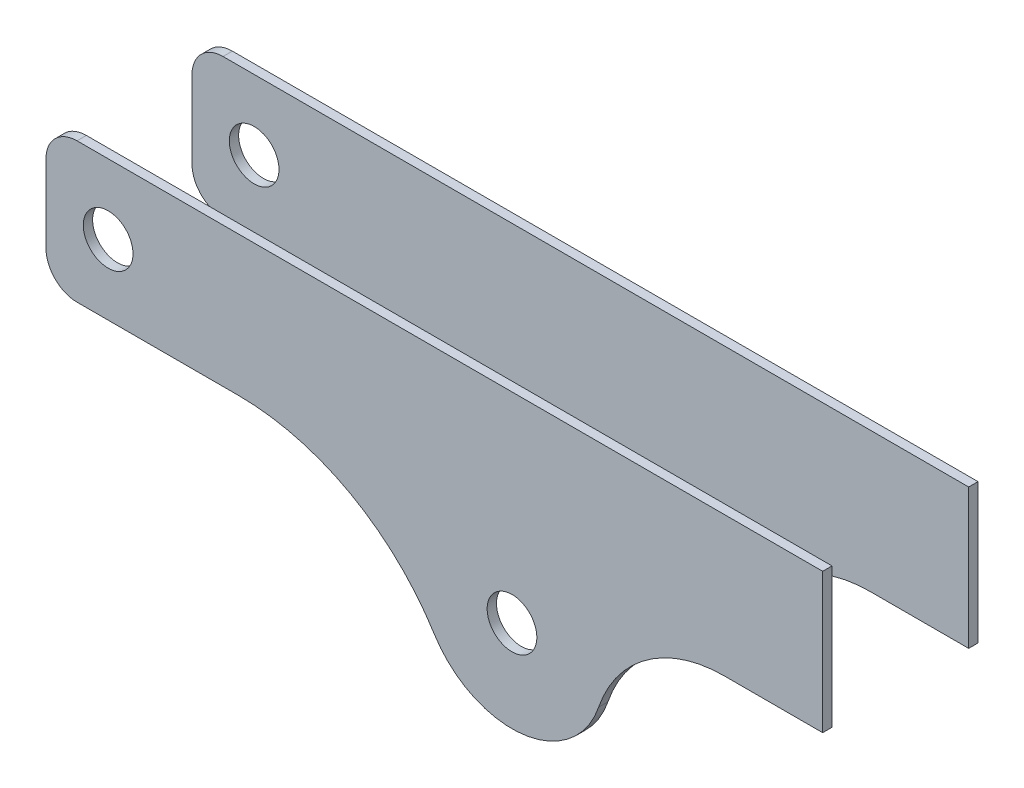
ISO-10303-21;
HEADER;
FILE_DESCRIPTION(('STEP AP214'),'2;1');
FILE_NAME('part.step','',(''),(''),'','','');
FILE_SCHEMA(('AUTOMOTIVE_DESIGN { 1 0 10303 214 1 1 1 1 }'));
ENDSEC;
DATA;
#1=APPLICATION_CONTEXT('core data for automotive mechanical design processes');
#2=APPLICATION_PROTOCOL_DEFINITION('international standard','automotive_design',2000,#1);
#3=PRODUCT_CONTEXT('',#1,'mechanical');
#4=PRODUCT('Part','Part','',(#3));
#5=PRODUCT_RELATED_PRODUCT_CATEGORY('part','',(#4));
#6=PRODUCT_DEFINITION_FORMATION('','',#4);
#7=PRODUCT_DEFINITION_CONTEXT('part definition',#1,'design');
#8=PRODUCT_DEFINITION('design','',#6,#7);
#9=PRODUCT_DEFINITION_SHAPE('','',#8);
#10=(LENGTH_UNIT() NAMED_UNIT(*) SI_UNIT(.MILLI.,.METRE.));
#11=(NAMED_UNIT(*) PLANE_ANGLE_UNIT() SI_UNIT($,.RADIAN.));
#12=(NAMED_UNIT(*) SI_UNIT($,.STERADIAN.) SOLID_ANGLE_UNIT());
#13=UNCERTAINTY_MEASURE_WITH_UNIT(LENGTH_MEASURE(1.E-05),#10,'distance_accuracy_value','');
#14=(GEOMETRIC_REPRESENTATION_CONTEXT(3) GLOBAL_UNCERTAINTY_ASSIGNED_CONTEXT((#13)) GLOBAL_UNIT_ASSIGNED_CONTEXT((#10,
#11,#12)) REPRESENTATION_CONTEXT('',''));
#15=CARTESIAN_POINT('',(0.,0.,0.));
#16=DIRECTION('',(0.,0.,1.));
#17=DIRECTION('',(1.,0.,0.));
#18=AXIS2_PLACEMENT_3D('',#15,#16,#17);
#19=CARTESIAN_POINT('',(61.832258709383,-119.470201974203,3.));
#20=DIRECTION('',(0.,0.,-1.));
#21=DIRECTION('',(-1.,0.,0.));
#22=AXIS2_PLACEMENT_3D('',#19,#20,#21);
#23=PLANE('',#22);
#24=CARTESIAN_POINT('',(20.,-22.5,3.));
#25=DIRECTION('',(0.,0.,1.));
#26=DIRECTION('',(1.,0.,0.));
#27=AXIS2_PLACEMENT_3D('',#24,#25,#26);
#28=CIRCLE('',#27,8.);
#29=CARTESIAN_POINT('',(28.,-22.5,3.));
#30=VERTEX_POINT('',#29);
#31=EDGE_CURVE('E52',#30,#30,#28,.T.);
#32=ORIENTED_EDGE('',*,*,#31,.F.);
#33=EDGE_LOOP('',(#32));
#34=FACE_BOUND('',#33,.T.);
#35=CARTESIAN_POINT('',(150.,-64.4572355491351,3.));
#36=DIRECTION('',(0.,0.,1.));
#37=DIRECTION('',(1.,0.,0.));
#38=AXIS2_PLACEMENT_3D('',#35,#36,#37);
#39=CIRCLE('',#38,8.00000000000001);
#40=CARTESIAN_POINT('',(158.,-64.4572355491351,3.));
#41=VERTEX_POINT('',#40);
#42=EDGE_CURVE('E174',#41,#41,#39,.T.);
#43=ORIENTED_EDGE('',*,*,#42,.F.);
#44=EDGE_LOOP('',(#43));
#45=FACE_BOUND('',#44,.T.);
#46=DIRECTION('',(0.,1.,0.));
#47=VECTOR('',#46,1.);
#48=CARTESIAN_POINT('',(250.,-45.,3.));
#49=LINE('',#48,#47);
#50=CARTESIAN_POINT('',(250.,-45.,3.));
#51=VERTEX_POINT('',#50);
#52=CARTESIAN_POINT('',(250.,0.,3.));
#53=VERTEX_POINT('',#52);
#54=EDGE_CURVE('E160',#51,#53,#49,.T.);
#55=ORIENTED_EDGE('',*,*,#54,.T.);
#56=DIRECTION('',(-1.,0.,0.));
#57=VECTOR('',#56,1.);
#58=CARTESIAN_POINT('',(250.,0.,3.));
#59=LINE('',#58,#57);
#60=CARTESIAN_POINT('',(10.0000000000001,0.,3.));
#61=VERTEX_POINT('',#60);
#62=EDGE_CURVE('E158',#53,#61,#59,.T.);
#63=ORIENTED_EDGE('',*,*,#62,.T.);
#64=CARTESIAN_POINT('',(10.,-10.,3.));
#65=DIRECTION('',(0.,0.,1.));
#66=DIRECTION('',(-1.,0.,0.));
#67=AXIS2_PLACEMENT_3D('',#64,#65,#66);
#68=CIRCLE('',#67,10.);
#69=CARTESIAN_POINT('',(0.,-10.0000000000001,3.));
#70=VERTEX_POINT('',#69);
#71=EDGE_CURVE('E156',#61,#70,#68,.T.);
#72=ORIENTED_EDGE('',*,*,#71,.T.);
#73=DIRECTION('',(0.,-1.,0.));
#74=VECTOR('',#73,1.);
#75=CARTESIAN_POINT('',(0.,-10.0000000000001,3.));
#76=LINE('',#75,#74);
#77=CARTESIAN_POINT('',(0.,-34.9999999999999,3.));
#78=VERTEX_POINT('',#77);
#79=EDGE_CURVE('E154',#70,#78,#76,.T.);
#80=ORIENTED_EDGE('',*,*,#79,.T.);
#81=CARTESIAN_POINT('',(10.,-35.,3.));
#82=DIRECTION('',(0.,0.,1.));
#83=DIRECTION('',(1.,0.,0.));
#84=AXIS2_PLACEMENT_3D('',#81,#82,#83);
#85=CIRCLE('',#84,10.);
#86=CARTESIAN_POINT('',(10.0000000000001,-45.,3.));
#87=VERTEX_POINT('',#86);
#88=EDGE_CURVE('E152',#78,#87,#85,.T.);
#89=ORIENTED_EDGE('',*,*,#88,.T.);
#90=DIRECTION('',(1.,0.,0.));
#91=VECTOR('',#90,1.);
#92=CARTESIAN_POINT('',(10.0000000000001,-45.,3.));
#93=LINE('',#92,#91);
#94=CARTESIAN_POINT('',(61.832258709383,-45.,3.));
#95=VERTEX_POINT('',#94);
#96=EDGE_CURVE('E150',#87,#95,#93,.T.);
#97=ORIENTED_EDGE('',*,*,#96,.T.);
#98=CARTESIAN_POINT('',(61.832258709383,-119.470201974203,3.));
#99=DIRECTION('',(0.,0.,-1.));
#100=DIRECTION('',(-1.,0.,0.));
#101=AXIS2_PLACEMENT_3D('',#98,#99,#100);
#102=CIRCLE('',#101,74.4702019742032);
#103=CARTESIAN_POINT('',(125.012434489142,-80.0484266397851,3.));
#104=VERTEX_POINT('',#103);
#105=EDGE_CURVE('E135',#95,#104,#102,.T.);
#106=ORIENTED_EDGE('',*,*,#105,.T.);
#107=CARTESIAN_POINT('',(150.,-64.4572355491351,3.));
#108=DIRECTION('',(0.,0.,1.));
#109=DIRECTION('',(1.,0.,0.));
#110=AXIS2_PLACEMENT_3D('',#107,#108,#109);
#111=CIRCLE('',#110,29.4527362019994);
#112=CARTESIAN_POINT('',(177.882550256076,-73.945494662479,3.));
#113=VERTEX_POINT('',#112);
#114=EDGE_CURVE('E168',#104,#113,#111,.T.);
#115=ORIENTED_EDGE('',*,*,#114,.T.);
#116=CARTESIAN_POINT('',(218.308062330828,-87.7020459761909,3.));
#117=DIRECTION('',(0.,0.,-1.));
#118=DIRECTION('',(-1.,0.,0.));
#119=AXIS2_PLACEMENT_3D('',#116,#117,#118);
#120=CIRCLE('',#119,42.7020459761909);
#121=CARTESIAN_POINT('',(218.308062330828,-45.,3.));
#122=VERTEX_POINT('',#121);
#123=EDGE_CURVE('E166',#113,#122,#120,.T.);
#124=ORIENTED_EDGE('',*,*,#123,.T.);
#125=DIRECTION('',(1.,0.,0.));
#126=VECTOR('',#125,1.);
#127=CARTESIAN_POINT('',(218.308062330828,-45.,3.));
#128=LINE('',#127,#126);
#129=EDGE_CURVE('E164',#122,#51,#128,.T.);
#130=ORIENTED_EDGE('',*,*,#129,.T.);
#131=EDGE_LOOP('',(#55,#63,#72,#80,#89,#97,#106,#115,#124,#130));
#132=FACE_BOUND('',#131,.T.);
#133=ADVANCED_FACE('F43',(#34,#45,#132),#23,.F.);
#134=CARTESIAN_POINT('',(250.,-45.,3.));
#135=DIRECTION('',(-1.,0.,0.));
#136=DIRECTION('',(0.,-1.,0.));
#137=AXIS2_PLACEMENT_3D('',#134,#135,#136);
#138=PLANE('',#137);
#139=DIRECTION('',(0.,0.,-1.));
#140=VECTOR('',#139,1.);
#141=CARTESIAN_POINT('',(250.,0.,-47.));
#142=LINE('',#141,#140);
#143=CARTESIAN_POINT('',(250.,0.,0.));
#144=VERTEX_POINT('',#143);
#145=EDGE_CURVE('E12',#53,#144,#142,.T.);
#146=ORIENTED_EDGE('',*,*,#145,.F.);
#147=ORIENTED_EDGE('',*,*,#54,.F.);
#148=DIRECTION('',(0.,0.,-1.));
#149=VECTOR('',#148,1.);
#150=CARTESIAN_POINT('',(250.,-45.,3.));
#151=LINE('',#150,#149);
#152=CARTESIAN_POINT('',(250.,-45.,0.));
#153=VERTEX_POINT('',#152);
#154=EDGE_CURVE('E163',#51,#153,#151,.T.);
#155=ORIENTED_EDGE('',*,*,#154,.T.);
#156=DIRECTION('',(0.,1.,0.));
#157=VECTOR('',#156,1.);
#158=CARTESIAN_POINT('',(250.,-45.,0.));
#159=LINE('',#158,#157);
#160=EDGE_CURVE('E173',#153,#144,#159,.T.);
#161=ORIENTED_EDGE('',*,*,#160,.T.);
#162=EDGE_LOOP('',(#146,#147,#155,#161));
#163=FACE_BOUND('',#162,.T.);
#164=ADVANCED_FACE('F45',(#163),#138,.F.);
#165=CARTESIAN_POINT('',(61.832258709383,-119.470201974203,0.));
#166=DIRECTION('',(0.,0.,-1.));
#167=DIRECTION('',(-1.,0.,0.));
#168=AXIS2_PLACEMENT_3D('',#165,#166,#167);
#169=PLANE('',#168);
#170=CARTESIAN_POINT('',(150.,-64.4572355491351,0.));
#171=DIRECTION('',(0.,0.,1.));
#172=DIRECTION('',(1.,0.,0.));
#173=AXIS2_PLACEMENT_3D('',#170,#171,#172);
#174=CIRCLE('',#173,8.00000000000001);
#175=CARTESIAN_POINT('',(158.,-64.4572355491351,0.));
#176=VERTEX_POINT('',#175);
#177=EDGE_CURVE('E145',#176,#176,#174,.T.);
#178=ORIENTED_EDGE('',*,*,#177,.T.);
#179=EDGE_LOOP('',(#178));
#180=FACE_BOUND('',#179,.T.);
#181=CARTESIAN_POINT('',(61.832258709383,-119.470201974203,0.));
#182=DIRECTION('',(0.,0.,-1.));
#183=DIRECTION('',(-1.,0.,0.));
#184=AXIS2_PLACEMENT_3D('',#181,#182,#183);
#185=CIRCLE('',#184,74.4702019742032);
#186=CARTESIAN_POINT('',(61.832258709383,-45.,0.));
#187=VERTEX_POINT('',#186);
#188=CARTESIAN_POINT('',(125.012434489142,-80.0484266397851,0.));
#189=VERTEX_POINT('',#188);
#190=EDGE_CURVE('E133',#187,#189,#185,.T.);
#191=ORIENTED_EDGE('',*,*,#190,.F.);
#192=DIRECTION('',(1.,0.,0.));
#193=VECTOR('',#192,1.);
#194=CARTESIAN_POINT('',(10.0000000000001,-45.,0.));
#195=LINE('',#194,#193);
#196=CARTESIAN_POINT('',(10.0000000000001,-45.,0.));
#197=VERTEX_POINT('',#196);
#198=EDGE_CURVE('E117',#197,#187,#195,.T.);
#199=ORIENTED_EDGE('',*,*,#198,.F.);
#200=CARTESIAN_POINT('',(10.,-35.,0.));
#201=DIRECTION('',(0.,0.,1.));
#202=DIRECTION('',(1.,0.,0.));
#203=AXIS2_PLACEMENT_3D('',#200,#201,#202);
#204=CIRCLE('',#203,10.);
#205=CARTESIAN_POINT('',(0.,-34.9999999999999,0.));
#206=VERTEX_POINT('',#205);
#207=EDGE_CURVE('E216',#206,#197,#204,.T.);
#208=ORIENTED_EDGE('',*,*,#207,.F.);
#209=DIRECTION('',(0.,-1.,0.));
#210=VECTOR('',#209,1.);
#211=CARTESIAN_POINT('',(0.,-10.0000000000001,0.));
#212=LINE('',#211,#210);
#213=CARTESIAN_POINT('',(0.,-10.0000000000001,0.));
#214=VERTEX_POINT('',#213);
#215=EDGE_CURVE('E201',#214,#206,#212,.T.);
#216=ORIENTED_EDGE('',*,*,#215,.F.);
#217=CARTESIAN_POINT('',(10.,-10.,0.));
#218=DIRECTION('',(0.,0.,1.));
#219=DIRECTION('',(-1.,0.,0.));
#220=AXIS2_PLACEMENT_3D('',#217,#218,#219);
#221=CIRCLE('',#220,10.);
#222=CARTESIAN_POINT('',(10.0000000000001,0.,0.));
#223=VERTEX_POINT('',#222);
#224=EDGE_CURVE('E202',#223,#214,#221,.T.);
#225=ORIENTED_EDGE('',*,*,#224,.F.);
#226=DIRECTION('',(-1.,0.,0.));
#227=VECTOR('',#226,1.);
#228=CARTESIAN_POINT('',(250.,0.,0.));
#229=LINE('',#228,#227);
#230=EDGE_CURVE('E58',#144,#223,#229,.T.);
#231=ORIENTED_EDGE('',*,*,#230,.F.);
#232=ORIENTED_EDGE('',*,*,#160,.F.);
#233=DIRECTION('',(1.,0.,0.));
#234=VECTOR('',#233,1.);
#235=CARTESIAN_POINT('',(218.308062330828,-45.,0.));
#236=LINE('',#235,#234);
#237=CARTESIAN_POINT('',(218.308062330828,-45.,0.));
#238=VERTEX_POINT('',#237);
#239=EDGE_CURVE('E229',#238,#153,#236,.T.);
#240=ORIENTED_EDGE('',*,*,#239,.F.);
#241=CARTESIAN_POINT('',(218.308062330828,-87.7020459761909,0.));
#242=DIRECTION('',(0.,0.,-1.));
#243=DIRECTION('',(-1.,0.,0.));
#244=AXIS2_PLACEMENT_3D('',#241,#242,#243);
#245=CIRCLE('',#244,42.7020459761909);
#246=CARTESIAN_POINT('',(177.882550256076,-73.945494662479,0.));
#247=VERTEX_POINT('',#246);
#248=EDGE_CURVE('E223',#247,#238,#245,.T.);
#249=ORIENTED_EDGE('',*,*,#248,.F.);
#250=CARTESIAN_POINT('',(150.,-64.4572355491351,0.));
#251=DIRECTION('',(0.,0.,1.));
#252=DIRECTION('',(1.,0.,0.));
#253=AXIS2_PLACEMENT_3D('',#250,#251,#252);
#254=CIRCLE('',#253,29.4527362019994);
#255=EDGE_CURVE('E136',#189,#247,#254,.T.);
#256=ORIENTED_EDGE('',*,*,#255,.F.);
#257=EDGE_LOOP('',(#191,#199,#208,#216,#225,#231,#232,#240,#249,#256));
#258=FACE_BOUND('',#257,.T.);
#259=CARTESIAN_POINT('',(20.,-22.5,0.));
#260=DIRECTION('',(0.,0.,1.));
#261=DIRECTION('',(1.,0.,0.));
#262=AXIS2_PLACEMENT_3D('',#259,#260,#261);
#263=CIRCLE('',#262,8.);
#264=CARTESIAN_POINT('',(28.,-22.5,0.));
#265=VERTEX_POINT('',#264);
#266=EDGE_CURVE('E142',#265,#265,#263,.T.);
#267=ORIENTED_EDGE('',*,*,#266,.T.);
#268=EDGE_LOOP('',(#267));
#269=FACE_BOUND('',#268,.T.);
#270=ADVANCED_FACE('F138',(#180,#258,#269),#169,.T.);
#271=CARTESIAN_POINT('',(61.832258709383,-119.470201974203,3.));
#272=DIRECTION('',(0.,0.,-1.));
#273=DIRECTION('',(-1.,0.,0.));
#274=AXIS2_PLACEMENT_3D('',#271,#272,#273);
#275=CYLINDRICAL_SURFACE('',#274,74.4702019742032);
#276=ORIENTED_EDGE('',*,*,#190,.T.);
#277=DIRECTION('',(0.,0.,-1.));
#278=VECTOR('',#277,1.);
#279=CARTESIAN_POINT('',(125.012434489142,-80.0484266397851,3.));
#280=LINE('',#279,#278);
#281=EDGE_CURVE('E221',#104,#189,#280,.T.);
#282=ORIENTED_EDGE('',*,*,#281,.F.);
#283=ORIENTED_EDGE('',*,*,#105,.F.);
#284=DIRECTION('',(0.,0.,-1.));
#285=VECTOR('',#284,1.);
#286=CARTESIAN_POINT('',(61.832258709383,-45.,3.));
#287=LINE('',#286,#285);
#288=EDGE_CURVE('E121',#95,#187,#287,.T.);
#289=ORIENTED_EDGE('',*,*,#288,.T.);
#290=EDGE_LOOP('',(#276,#282,#283,#289));
#291=FACE_BOUND('',#290,.T.);
#292=ADVANCED_FACE('F131',(#291),#275,.F.);
#293=CARTESIAN_POINT('',(150.,-64.4572355491351,3.));
#294=DIRECTION('',(0.,0.,-1.));
#295=DIRECTION('',(-1.,0.,0.));
#296=AXIS2_PLACEMENT_3D('',#293,#294,#295);
#297=CYLINDRICAL_SURFACE('',#296,29.4527362019994);
#298=ORIENTED_EDGE('',*,*,#255,.T.);
#299=DIRECTION('',(0.,0.,-1.));
#300=VECTOR('',#299,1.);
#301=CARTESIAN_POINT('',(177.882550256076,-73.945494662479,3.));
#302=LINE('',#301,#300);
#303=EDGE_CURVE('E225',#113,#247,#302,.T.);
#304=ORIENTED_EDGE('',*,*,#303,.F.);
#305=ORIENTED_EDGE('',*,*,#114,.F.);
#306=ORIENTED_EDGE('',*,*,#281,.T.);
#307=EDGE_LOOP('',(#298,#304,#305,#306));
#308=FACE_BOUND('',#307,.T.);
#309=ADVANCED_FACE('F247',(#308),#297,.T.);
#310=CARTESIAN_POINT('',(218.308062330828,-87.7020459761909,3.));
#311=DIRECTION('',(0.,0.,-1.));
#312=DIRECTION('',(-1.,0.,0.));
#313=AXIS2_PLACEMENT_3D('',#310,#311,#312);
#314=CYLINDRICAL_SURFACE('',#313,42.7020459761909);
#315=ORIENTED_EDGE('',*,*,#248,.T.);
#316=DIRECTION('',(0.,0.,-1.));
#317=VECTOR('',#316,1.);
#318=CARTESIAN_POINT('',(218.308062330828,-45.,3.));
#319=LINE('',#318,#317);
#320=EDGE_CURVE('E230',#122,#238,#319,.T.);
#321=ORIENTED_EDGE('',*,*,#320,.F.);
#322=ORIENTED_EDGE('',*,*,#123,.F.);
#323=ORIENTED_EDGE('',*,*,#303,.T.);
#324=EDGE_LOOP('',(#315,#321,#322,#323));
#325=FACE_BOUND('',#324,.T.);
#326=ADVANCED_FACE('F245',(#325),#314,.F.);
#327=CARTESIAN_POINT('',(218.308062330828,-45.,3.));
#328=DIRECTION('',(0.,1.,0.));
#329=DIRECTION('',(0.,0.,1.));
#330=AXIS2_PLACEMENT_3D('',#327,#328,#329);
#331=PLANE('',#330);
#332=ORIENTED_EDGE('',*,*,#239,.T.);
#333=ORIENTED_EDGE('',*,*,#154,.F.);
#334=ORIENTED_EDGE('',*,*,#129,.F.);
#335=ORIENTED_EDGE('',*,*,#320,.T.);
#336=EDGE_LOOP('',(#332,#333,#334,#335));
#337=FACE_BOUND('',#336,.T.);
#338=ADVANCED_FACE('F242',(#337),#331,.F.);
#339=CARTESIAN_POINT('',(250.,0.,3.));
#340=DIRECTION('',(0.,-1.,0.));
#341=DIRECTION('',(1.,0.,0.));
#342=AXIS2_PLACEMENT_3D('',#339,#340,#341);
#343=PLANE('',#342);
#344=ORIENTED_EDGE('',*,*,#62,.F.);
#345=ORIENTED_EDGE('',*,*,#145,.T.);
#346=ORIENTED_EDGE('',*,*,#230,.T.);
#347=DIRECTION('',(0.,0.,-1.));
#348=VECTOR('',#347,1.);
#349=CARTESIAN_POINT('',(10.0000000000001,0.,3.));
#350=LINE('',#349,#348);
#351=EDGE_CURVE('E198',#61,#223,#350,.T.);
#352=ORIENTED_EDGE('',*,*,#351,.F.);
#353=EDGE_LOOP('',(#344,#345,#346,#352));
#354=FACE_BOUND('',#353,.T.);
#355=ADVANCED_FACE('F196',(#354),#343,.F.);
#356=CARTESIAN_POINT('',(10.,-10.,3.));
#357=DIRECTION('',(0.,0.,-1.));
#358=DIRECTION('',(-1.,0.,0.));
#359=AXIS2_PLACEMENT_3D('',#356,#357,#358);
#360=CYLINDRICAL_SURFACE('',#359,10.);
#361=ORIENTED_EDGE('',*,*,#224,.T.);
#362=DIRECTION('',(0.,0.,-1.));
#363=VECTOR('',#362,1.);
#364=CARTESIAN_POINT('',(0.,-10.0000000000001,3.));
#365=LINE('',#364,#363);
#366=EDGE_CURVE('E207',#70,#214,#365,.T.);
#367=ORIENTED_EDGE('',*,*,#366,.F.);
#368=ORIENTED_EDGE('',*,*,#71,.F.);
#369=ORIENTED_EDGE('',*,*,#351,.T.);
#370=EDGE_LOOP('',(#361,#367,#368,#369));
#371=FACE_BOUND('',#370,.T.);
#372=ADVANCED_FACE('F205',(#371),#360,.T.);
#373=CARTESIAN_POINT('',(0.,-10.0000000000001,3.));
#374=DIRECTION('',(1.,0.,0.));
#375=DIRECTION('',(0.,1.,0.));
#376=AXIS2_PLACEMENT_3D('',#373,#374,#375);
#377=PLANE('',#376);
#378=ORIENTED_EDGE('',*,*,#215,.T.);
#379=DIRECTION('',(0.,0.,-1.));
#380=VECTOR('',#379,1.);
#381=CARTESIAN_POINT('',(0.,-34.9999999999999,3.));
#382=LINE('',#381,#380);
#383=EDGE_CURVE('E127',#78,#206,#382,.T.);
#384=ORIENTED_EDGE('',*,*,#383,.F.);
#385=ORIENTED_EDGE('',*,*,#79,.F.);
#386=ORIENTED_EDGE('',*,*,#366,.T.);
#387=EDGE_LOOP('',(#378,#384,#385,#386));
#388=FACE_BOUND('',#387,.T.);
#389=ADVANCED_FACE('F213',(#388),#377,.F.);
#390=CARTESIAN_POINT('',(10.,-35.,3.));
#391=DIRECTION('',(0.,0.,-1.));
#392=DIRECTION('',(-1.,0.,0.));
#393=AXIS2_PLACEMENT_3D('',#390,#391,#392);
#394=CYLINDRICAL_SURFACE('',#393,10.);
#395=ORIENTED_EDGE('',*,*,#207,.T.);
#396=DIRECTION('',(0.,0.,-1.));
#397=VECTOR('',#396,1.);
#398=CARTESIAN_POINT('',(10.0000000000001,-45.,3.));
#399=LINE('',#398,#397);
#400=EDGE_CURVE('E124',#87,#197,#399,.T.);
#401=ORIENTED_EDGE('',*,*,#400,.F.);
#402=ORIENTED_EDGE('',*,*,#88,.F.);
#403=ORIENTED_EDGE('',*,*,#383,.T.);
#404=EDGE_LOOP('',(#395,#401,#402,#403));
#405=FACE_BOUND('',#404,.T.);
#406=ADVANCED_FACE('F218',(#405),#394,.T.);
#407=CARTESIAN_POINT('',(10.0000000000001,-45.,3.));
#408=DIRECTION('',(0.,1.,0.));
#409=DIRECTION('',(0.,0.,1.));
#410=AXIS2_PLACEMENT_3D('',#407,#408,#409);
#411=PLANE('',#410);
#412=ORIENTED_EDGE('',*,*,#198,.T.);
#413=ORIENTED_EDGE('',*,*,#288,.F.);
#414=ORIENTED_EDGE('',*,*,#96,.F.);
#415=ORIENTED_EDGE('',*,*,#400,.T.);
#416=EDGE_LOOP('',(#412,#413,#414,#415));
#417=FACE_BOUND('',#416,.T.);
#418=ADVANCED_FACE('F119',(#417),#411,.F.);
#419=CARTESIAN_POINT('',(150.,-64.4572355491351,3.));
#420=DIRECTION('',(0.,0.,-1.));
#421=DIRECTION('',(-1.,0.,0.));
#422=AXIS2_PLACEMENT_3D('',#419,#420,#421);
#423=CYLINDRICAL_SURFACE('',#422,8.00000000000001);
#424=ORIENTED_EDGE('',*,*,#42,.T.);
#425=EDGE_LOOP('',(#424));
#426=FACE_BOUND('',#425,.T.);
#427=ORIENTED_EDGE('',*,*,#177,.F.);
#428=EDGE_LOOP('',(#427));
#429=FACE_BOUND('',#428,.T.);
#430=ADVANCED_FACE('F269',(#426,#429),#423,.F.);
#431=CARTESIAN_POINT('',(20.,-22.5,3.));
#432=DIRECTION('',(0.,0.,-1.));
#433=DIRECTION('',(-1.,0.,0.));
#434=AXIS2_PLACEMENT_3D('',#431,#432,#433);
#435=CYLINDRICAL_SURFACE('',#434,8.);
#436=ORIENTED_EDGE('',*,*,#31,.T.);
#437=EDGE_LOOP('',(#436));
#438=FACE_BOUND('',#437,.T.);
#439=ORIENTED_EDGE('',*,*,#266,.F.);
#440=EDGE_LOOP('',(#439));
#441=FACE_BOUND('',#440,.T.);
#442=ADVANCED_FACE('F179',(#438,#441),#435,.F.);
#443=CLOSED_SHELL('',(#133,#164,#270,#292,#309,#326,#338,#355,#372,#389,#406,#418,#430,#442));
#444=MANIFOLD_SOLID_BREP('B2',#443);
#445=CARTESIAN_POINT('',(61.832258709383,-45.,-44.));
#446=DIRECTION('',(0.,-1.,0.));
#447=DIRECTION('',(1.,0.,0.));
#448=AXIS2_PLACEMENT_3D('',#445,#446,#447);
#449=PLANE('',#448);
#450=DIRECTION('',(-1.,0.,0.));
#451=VECTOR('',#450,1.);
#452=CARTESIAN_POINT('',(61.832258709383,-45.,-47.));
#453=LINE('',#452,#451);
#454=CARTESIAN_POINT('',(61.832258709383,-45.,-47.));
#455=VERTEX_POINT('',#454);
#456=CARTESIAN_POINT('',(10.0000000000001,-45.,-47.));
#457=VERTEX_POINT('',#456);
#458=EDGE_CURVE('E489',#455,#457,#453,.T.);
#459=ORIENTED_EDGE('',*,*,#458,.F.);
#460=DIRECTION('',(0.,0.,-1.));
#461=VECTOR('',#460,1.);
#462=CARTESIAN_POINT('',(61.832258709383,-45.,-44.));
#463=LINE('',#462,#461);
#464=CARTESIAN_POINT('',(61.832258709383,-45.,-44.));
#465=VERTEX_POINT('',#464);
#466=EDGE_CURVE('E438',#465,#455,#463,.T.);
#467=ORIENTED_EDGE('',*,*,#466,.F.);
#468=DIRECTION('',(-1.,0.,0.));
#469=VECTOR('',#468,1.);
#470=CARTESIAN_POINT('',(61.832258709383,-45.,-44.));
#471=LINE('',#470,#469);
#472=CARTESIAN_POINT('',(10.0000000000001,-45.,-44.));
#473=VERTEX_POINT('',#472);
#474=EDGE_CURVE('E575',#465,#473,#471,.T.);
#475=ORIENTED_EDGE('',*,*,#474,.T.);
#476=DIRECTION('',(0.,0.,-1.));
#477=VECTOR('',#476,1.);
#478=CARTESIAN_POINT('',(10.0000000000001,-45.,-44.));
#479=LINE('',#478,#477);
#480=EDGE_CURVE('E522',#473,#457,#479,.T.);
#481=ORIENTED_EDGE('',*,*,#480,.T.);
#482=EDGE_LOOP('',(#459,#467,#475,#481));
#483=FACE_BOUND('',#482,.T.);
#484=ADVANCED_FACE('F377',(#483),#449,.T.);
#485=CARTESIAN_POINT('',(10.,-35.,-44.));
#486=DIRECTION('',(0.,0.,-1.));
#487=DIRECTION('',(-1.,0.,0.));
#488=AXIS2_PLACEMENT_3D('',#485,#486,#487);
#489=CYLINDRICAL_SURFACE('',#488,10.);
#490=CARTESIAN_POINT('',(10.,-35.,-47.));
#491=DIRECTION('',(0.,0.,-1.));
#492=DIRECTION('',(-1.,0.,0.));
#493=AXIS2_PLACEMENT_3D('',#490,#491,#492);
#494=CIRCLE('',#493,10.);
#495=CARTESIAN_POINT('',(0.,-35.,-47.));
#496=VERTEX_POINT('',#495);
#497=EDGE_CURVE('E493',#457,#496,#494,.T.);
#498=ORIENTED_EDGE('',*,*,#497,.F.);
#499=ORIENTED_EDGE('',*,*,#480,.F.);
#500=CARTESIAN_POINT('',(10.,-35.,-44.));
#501=DIRECTION('',(0.,0.,-1.));
#502=DIRECTION('',(-1.,0.,0.));
#503=AXIS2_PLACEMENT_3D('',#500,#501,#502);
#504=CIRCLE('',#503,10.);
#505=CARTESIAN_POINT('',(0.,-35.,-44.));
#506=VERTEX_POINT('',#505);
#507=EDGE_CURVE('E577',#473,#506,#504,.T.);
#508=ORIENTED_EDGE('',*,*,#507,.T.);
#509=DIRECTION('',(0.,0.,-1.));
#510=VECTOR('',#509,1.);
#511=CARTESIAN_POINT('',(0.,-35.,-44.));
#512=LINE('',#511,#510);
#513=EDGE_CURVE('E520',#506,#496,#512,.T.);
#514=ORIENTED_EDGE('',*,*,#513,.T.);
#515=EDGE_LOOP('',(#498,#499,#508,#514));
#516=FACE_BOUND('',#515,.T.);
#517=ADVANCED_FACE('F539',(#516),#489,.T.);
#518=CARTESIAN_POINT('',(0.,-34.9999999999999,-44.));
#519=DIRECTION('',(-1.,0.,0.));
#520=DIRECTION('',(0.,-1.,0.));
#521=AXIS2_PLACEMENT_3D('',#518,#519,#520);
#522=PLANE('',#521);
#523=DIRECTION('',(0.,1.,0.));
#524=VECTOR('',#523,1.);
#525=CARTESIAN_POINT('',(0.,-34.9999999999999,-47.));
#526=LINE('',#525,#524);
#527=CARTESIAN_POINT('',(0.,-10.0000000000001,-47.));
#528=VERTEX_POINT('',#527);
#529=EDGE_CURVE('E496',#496,#528,#526,.T.);
#530=ORIENTED_EDGE('',*,*,#529,.F.);
#531=ORIENTED_EDGE('',*,*,#513,.F.);
#532=DIRECTION('',(0.,1.,0.));
#533=VECTOR('',#532,1.);
#534=CARTESIAN_POINT('',(0.,-34.9999999999999,-44.));
#535=LINE('',#534,#533);
#536=CARTESIAN_POINT('',(0.,-10.0000000000001,-44.));
#537=VERTEX_POINT('',#536);
#538=EDGE_CURVE('E580',#506,#537,#535,.T.);
#539=ORIENTED_EDGE('',*,*,#538,.T.);
#540=DIRECTION('',(0.,0.,-1.));
#541=VECTOR('',#540,1.);
#542=CARTESIAN_POINT('',(0.,-10.0000000000001,-44.));
#543=LINE('',#542,#541);
#544=EDGE_CURVE('E518',#537,#528,#543,.T.);
#545=ORIENTED_EDGE('',*,*,#544,.T.);
#546=EDGE_LOOP('',(#530,#531,#539,#545));
#547=FACE_BOUND('',#546,.T.);
#548=ADVANCED_FACE('F544',(#547),#522,.T.);
#549=CARTESIAN_POINT('',(10.,-10.,-44.));
#550=DIRECTION('',(0.,0.,-1.));
#551=DIRECTION('',(-1.,0.,0.));
#552=AXIS2_PLACEMENT_3D('',#549,#550,#551);
#553=CYLINDRICAL_SURFACE('',#552,10.);
#554=CARTESIAN_POINT('',(10.,-10.,-47.));
#555=DIRECTION('',(0.,0.,-1.));
#556=DIRECTION('',(-1.,0.,0.));
#557=AXIS2_PLACEMENT_3D('',#554,#555,#556);
#558=CIRCLE('',#557,10.);
#559=CARTESIAN_POINT('',(10.0000000000001,0.,-47.));
#560=VERTEX_POINT('',#559);
#561=EDGE_CURVE('E499',#528,#560,#558,.T.);
#562=ORIENTED_EDGE('',*,*,#561,.F.);
#563=ORIENTED_EDGE('',*,*,#544,.F.);
#564=CARTESIAN_POINT('',(10.,-10.,-44.));
#565=DIRECTION('',(0.,0.,-1.));
#566=DIRECTION('',(-1.,0.,0.));
#567=AXIS2_PLACEMENT_3D('',#564,#565,#566);
#568=CIRCLE('',#567,10.);
#569=CARTESIAN_POINT('',(10.0000000000001,0.,-44.));
#570=VERTEX_POINT('',#569);
#571=EDGE_CURVE('E583',#537,#570,#568,.T.);
#572=ORIENTED_EDGE('',*,*,#571,.T.);
#573=DIRECTION('',(0.,0.,-1.));
#574=VECTOR('',#573,1.);
#575=CARTESIAN_POINT('',(10.0000000000001,0.,-44.));
#576=LINE('',#575,#574);
#577=EDGE_CURVE('E515',#570,#560,#576,.T.);
#578=ORIENTED_EDGE('',*,*,#577,.T.);
#579=EDGE_LOOP('',(#562,#563,#572,#578));
#580=FACE_BOUND('',#579,.T.);
#581=ADVANCED_FACE('F633',(#580),#553,.T.);
#582=CARTESIAN_POINT('',(250.,-45.,-44.));
#583=DIRECTION('',(0.,-1.,0.));
#584=DIRECTION('',(0.,0.,-1.));
#585=AXIS2_PLACEMENT_3D('',#582,#583,#584);
#586=PLANE('',#585);
#587=DIRECTION('',(-1.,0.,0.));
#588=VECTOR('',#587,1.);
#589=CARTESIAN_POINT('',(250.,-45.,-47.));
#590=LINE('',#589,#588);
#591=CARTESIAN_POINT('',(250.,-45.,-47.));
#592=VERTEX_POINT('',#591);
#593=CARTESIAN_POINT('',(218.308062330828,-45.,-47.));
#594=VERTEX_POINT('',#593);
#595=EDGE_CURVE('E505',#592,#594,#590,.T.);
#596=ORIENTED_EDGE('',*,*,#595,.F.);
#597=DIRECTION('',(0.,0.,-1.));
#598=VECTOR('',#597,1.);
#599=CARTESIAN_POINT('',(250.,-45.,-44.));
#600=LINE('',#599,#598);
#601=CARTESIAN_POINT('',(250.,-45.,-44.));
#602=VERTEX_POINT('',#601);
#603=EDGE_CURVE('E467',#602,#592,#600,.T.);
#604=ORIENTED_EDGE('',*,*,#603,.F.);
#605=DIRECTION('',(-1.,0.,0.));
#606=VECTOR('',#605,1.);
#607=CARTESIAN_POINT('',(250.,-45.,-44.));
#608=LINE('',#607,#606);
#609=CARTESIAN_POINT('',(218.308062330828,-45.,-44.));
#610=VERTEX_POINT('',#609);
#611=EDGE_CURVE('E473',#602,#610,#608,.T.);
#612=ORIENTED_EDGE('',*,*,#611,.T.);
#613=DIRECTION('',(0.,0.,-1.));
#614=VECTOR('',#613,1.);
#615=CARTESIAN_POINT('',(218.308062330828,-45.,-44.));
#616=LINE('',#615,#614);
#617=EDGE_CURVE('E457',#610,#594,#616,.T.);
#618=ORIENTED_EDGE('',*,*,#617,.T.);
#619=EDGE_LOOP('',(#596,#604,#612,#618));
#620=FACE_BOUND('',#619,.T.);
#621=ADVANCED_FACE('F477',(#620),#586,.T.);
#622=CARTESIAN_POINT('',(218.308062330828,-87.7020459761909,-44.));
#623=DIRECTION('',(0.,0.,-1.));
#624=DIRECTION('',(-1.,0.,0.));
#625=AXIS2_PLACEMENT_3D('',#622,#623,#624);
#626=CYLINDRICAL_SURFACE('',#625,42.7020459761909);
#627=CARTESIAN_POINT('',(218.308062330828,-87.7020459761909,-47.));
#628=DIRECTION('',(0.,0.,1.));
#629=DIRECTION('',(-1.,0.,0.));
#630=AXIS2_PLACEMENT_3D('',#627,#628,#629);
#631=CIRCLE('',#630,42.7020459761909);
#632=CARTESIAN_POINT('',(177.882550256076,-73.945494662479,-47.));
#633=VERTEX_POINT('',#632);
#634=EDGE_CURVE('E462',#594,#633,#631,.T.);
#635=ORIENTED_EDGE('',*,*,#634,.F.);
#636=ORIENTED_EDGE('',*,*,#617,.F.);
#637=CARTESIAN_POINT('',(218.308062330828,-87.7020459761909,-44.));
#638=DIRECTION('',(0.,0.,1.));
#639=DIRECTION('',(-1.,0.,0.));
#640=AXIS2_PLACEMENT_3D('',#637,#638,#639);
#641=CIRCLE('',#640,42.7020459761909);
#642=CARTESIAN_POINT('',(177.882550256076,-73.945494662479,-44.));
#643=VERTEX_POINT('',#642);
#644=EDGE_CURVE('E460',#610,#643,#641,.T.);
#645=ORIENTED_EDGE('',*,*,#644,.T.);
#646=DIRECTION('',(0.,0.,-1.));
#647=VECTOR('',#646,1.);
#648=CARTESIAN_POINT('',(177.882550256076,-73.945494662479,-44.));
#649=LINE('',#648,#647);
#650=EDGE_CURVE('E426',#643,#633,#649,.T.);
#651=ORIENTED_EDGE('',*,*,#650,.T.);
#652=EDGE_LOOP('',(#635,#636,#645,#651));
#653=FACE_BOUND('',#652,.T.);
#654=ADVANCED_FACE('F459',(#653),#626,.F.);
#655=CARTESIAN_POINT('',(150.,-64.4572355491351,-44.));
#656=DIRECTION('',(0.,0.,-1.));
#657=DIRECTION('',(-1.,0.,0.));
#658=AXIS2_PLACEMENT_3D('',#655,#656,#657);
#659=CYLINDRICAL_SURFACE('',#658,29.4527362019994);
#660=CARTESIAN_POINT('',(150.,-64.4572355491351,-47.));
#661=DIRECTION('',(0.,0.,-1.));
#662=DIRECTION('',(-1.,0.,0.));
#663=AXIS2_PLACEMENT_3D('',#660,#661,#662);
#664=CIRCLE('',#663,29.4527362019994);
#665=CARTESIAN_POINT('',(125.012434489142,-80.0484266397851,-47.));
#666=VERTEX_POINT('',#665);
#667=EDGE_CURVE('E508',#633,#666,#664,.T.);
#668=ORIENTED_EDGE('',*,*,#667,.F.);
#669=ORIENTED_EDGE('',*,*,#650,.F.);
#670=CARTESIAN_POINT('',(150.,-64.4572355491351,-44.));
#671=DIRECTION('',(0.,0.,-1.));
#672=DIRECTION('',(-1.,0.,0.));
#673=AXIS2_PLACEMENT_3D('',#670,#671,#672);
#674=CIRCLE('',#673,29.4527362019994);
#675=CARTESIAN_POINT('',(125.012434489142,-80.0484266397851,-44.));
#676=VERTEX_POINT('',#675);
#677=EDGE_CURVE('E475',#643,#676,#674,.T.);
#678=ORIENTED_EDGE('',*,*,#677,.T.);
#679=DIRECTION('',(0.,0.,-1.));
#680=VECTOR('',#679,1.);
#681=CARTESIAN_POINT('',(125.012434489142,-80.0484266397851,-44.));
#682=LINE('',#681,#680);
#683=EDGE_CURVE('E386',#676,#666,#682,.T.);
#684=ORIENTED_EDGE('',*,*,#683,.T.);
#685=EDGE_LOOP('',(#668,#669,#678,#684));
#686=FACE_BOUND('',#685,.T.);
#687=ADVANCED_FACE('F527',(#686),#659,.T.);
#688=CARTESIAN_POINT('',(61.832258709383,-119.470201974203,-44.));
#689=DIRECTION('',(0.,0.,-1.));
#690=DIRECTION('',(-1.,0.,0.));
#691=AXIS2_PLACEMENT_3D('',#688,#689,#690);
#692=CYLINDRICAL_SURFACE('',#691,74.4702019742032);
#693=CARTESIAN_POINT('',(61.832258709383,-119.470201974203,-47.));
#694=DIRECTION('',(0.,0.,1.));
#695=DIRECTION('',(-1.,0.,0.));
#696=AXIS2_PLACEMENT_3D('',#693,#694,#695);
#697=CIRCLE('',#696,74.4702019742032);
#698=EDGE_CURVE('E486',#666,#455,#697,.T.);
#699=ORIENTED_EDGE('',*,*,#698,.F.);
#700=ORIENTED_EDGE('',*,*,#683,.F.);
#701=CARTESIAN_POINT('',(61.832258709383,-119.470201974203,-44.));
#702=DIRECTION('',(0.,0.,1.));
#703=DIRECTION('',(-1.,0.,0.));
#704=AXIS2_PLACEMENT_3D('',#701,#702,#703);
#705=CIRCLE('',#704,74.4702019742032);
#706=EDGE_CURVE('E511',#676,#465,#705,.T.);
#707=ORIENTED_EDGE('',*,*,#706,.T.);
#708=ORIENTED_EDGE('',*,*,#466,.T.);
#709=EDGE_LOOP('',(#699,#700,#707,#708));
#710=FACE_BOUND('',#709,.T.);
#711=ADVANCED_FACE('F523',(#710),#692,.F.);
#712=CARTESIAN_POINT('',(20.,-22.5,-44.));
#713=DIRECTION('',(0.,0.,-1.));
#714=DIRECTION('',(-1.,0.,0.));
#715=AXIS2_PLACEMENT_3D('',#712,#713,#714);
#716=CYLINDRICAL_SURFACE('',#715,8.);
#717=CARTESIAN_POINT('',(20.,-22.5,-44.));
#718=DIRECTION('',(0.,0.,-1.));
#719=DIRECTION('',(-1.,0.,0.));
#720=AXIS2_PLACEMENT_3D('',#717,#718,#719);
#721=CIRCLE('',#720,8.);
#722=CARTESIAN_POINT('',(12.,-22.5,-44.));
#723=VERTEX_POINT('',#722);
#724=EDGE_CURVE('E490',#723,#723,#721,.T.);
#725=ORIENTED_EDGE('',*,*,#724,.F.);
#726=EDGE_LOOP('',(#725));
#727=FACE_BOUND('',#726,.T.);
#728=CARTESIAN_POINT('',(20.,-22.5,-47.));
#729=DIRECTION('',(0.,0.,-1.));
#730=DIRECTION('',(-1.,0.,0.));
#731=AXIS2_PLACEMENT_3D('',#728,#729,#730);
#732=CIRCLE('',#731,8.);
#733=CARTESIAN_POINT('',(12.,-22.5,-47.));
#734=VERTEX_POINT('',#733);
#735=EDGE_CURVE('E564',#734,#734,#732,.T.);
#736=ORIENTED_EDGE('',*,*,#735,.T.);
#737=EDGE_LOOP('',(#736));
#738=FACE_BOUND('',#737,.T.);
#739=ADVANCED_FACE('F534',(#727,#738),#716,.F.);
#740=CARTESIAN_POINT('',(150.,-64.4572355491351,-44.));
#741=DIRECTION('',(0.,0.,-1.));
#742=DIRECTION('',(-1.,0.,0.));
#743=AXIS2_PLACEMENT_3D('',#740,#741,#742);
#744=CYLINDRICAL_SURFACE('',#743,8.00000000000001);
#745=CARTESIAN_POINT('',(150.,-64.4572355491351,-44.));
#746=DIRECTION('',(0.,0.,-1.));
#747=DIRECTION('',(-1.,0.,0.));
#748=AXIS2_PLACEMENT_3D('',#745,#746,#747);
#749=CIRCLE('',#748,8.00000000000001);
#750=CARTESIAN_POINT('',(142.,-64.4572355491351,-44.));
#751=VERTEX_POINT('',#750);
#752=EDGE_CURVE('E566',#751,#751,#749,.T.);
#753=ORIENTED_EDGE('',*,*,#752,.F.);
#754=EDGE_LOOP('',(#753));
#755=FACE_BOUND('',#754,.T.);
#756=CARTESIAN_POINT('',(150.,-64.4572355491351,-47.));
#757=DIRECTION('',(0.,0.,-1.));
#758=DIRECTION('',(-1.,0.,0.));
#759=AXIS2_PLACEMENT_3D('',#756,#757,#758);
#760=CIRCLE('',#759,8.00000000000001);
#761=CARTESIAN_POINT('',(142.,-64.4572355491351,-47.));
#762=VERTEX_POINT('',#761);
#763=EDGE_CURVE('E561',#762,#762,#760,.T.);
#764=ORIENTED_EDGE('',*,*,#763,.T.);
#765=EDGE_LOOP('',(#764));
#766=FACE_BOUND('',#765,.T.);
#767=ADVANCED_FACE('F594',(#755,#766),#744,.F.);
#768=CARTESIAN_POINT('',(61.832258709383,-119.470201974203,-44.));
#769=DIRECTION('',(0.,0.,-1.));
#770=DIRECTION('',(-1.,0.,0.));
#771=AXIS2_PLACEMENT_3D('',#768,#769,#770);
#772=PLANE('',#771);
#773=ORIENTED_EDGE('',*,*,#752,.T.);
#774=EDGE_LOOP('',(#773));
#775=FACE_BOUND('',#774,.T.);
#776=ORIENTED_EDGE('',*,*,#724,.T.);
#777=EDGE_LOOP('',(#776));
#778=FACE_BOUND('',#777,.T.);
#779=ORIENTED_EDGE('',*,*,#706,.F.);
#780=ORIENTED_EDGE('',*,*,#677,.F.);
#781=ORIENTED_EDGE('',*,*,#644,.F.);
#782=ORIENTED_EDGE('',*,*,#611,.F.);
#783=DIRECTION('',(0.,-1.,0.));
#784=VECTOR('',#783,1.);
#785=CARTESIAN_POINT('',(250.,0.,-44.));
#786=LINE('',#785,#784);
#787=CARTESIAN_POINT('',(250.,0.,-44.));
#788=VERTEX_POINT('',#787);
#789=EDGE_CURVE('E479',#788,#602,#786,.T.);
#790=ORIENTED_EDGE('',*,*,#789,.F.);
#791=DIRECTION('',(1.,0.,0.));
#792=VECTOR('',#791,1.);
#793=CARTESIAN_POINT('',(10.0000000000001,0.,-44.));
#794=LINE('',#793,#792);
#795=EDGE_CURVE('E481',#570,#788,#794,.T.);
#796=ORIENTED_EDGE('',*,*,#795,.F.);
#797=ORIENTED_EDGE('',*,*,#571,.F.);
#798=ORIENTED_EDGE('',*,*,#538,.F.);
#799=ORIENTED_EDGE('',*,*,#507,.F.);
#800=ORIENTED_EDGE('',*,*,#474,.F.);
#801=EDGE_LOOP('',(#779,#780,#781,#782,#790,#796,#797,#798,#799,#800));
#802=FACE_BOUND('',#801,.T.);
#803=ADVANCED_FACE('F471',(#775,#778,#802),#772,.F.);
#804=CARTESIAN_POINT('',(25.,0.,-44.));
#805=DIRECTION('',(0.,1.,0.));
#806=DIRECTION('',(0.,0.,1.));
#807=AXIS2_PLACEMENT_3D('',#804,#805,#806);
#808=PLANE('',#807);
#809=ORIENTED_EDGE('',*,*,#577,.F.);
#810=ORIENTED_EDGE('',*,*,#795,.T.);
#811=DIRECTION('',(0.,0.,-1.));
#812=VECTOR('',#811,1.);
#813=CARTESIAN_POINT('',(250.,0.,-47.));
#814=LINE('',#813,#812);
#815=CARTESIAN_POINT('',(250.,0.,-47.));
#816=VERTEX_POINT('',#815);
#817=EDGE_CURVE('E590',#788,#816,#814,.T.);
#818=ORIENTED_EDGE('',*,*,#817,.T.);
#819=DIRECTION('',(1.,0.,0.));
#820=VECTOR('',#819,1.);
#821=CARTESIAN_POINT('',(25.,0.,-47.));
#822=LINE('',#821,#820);
#823=EDGE_CURVE('E502',#560,#816,#822,.T.);
#824=ORIENTED_EDGE('',*,*,#823,.F.);
#825=EDGE_LOOP('',(#809,#810,#818,#824));
#826=FACE_BOUND('',#825,.T.);
#827=ADVANCED_FACE('F549',(#826),#808,.T.);
#828=CARTESIAN_POINT('',(0.,0.,-47.));
#829=DIRECTION('',(0.,0.,-1.));
#830=DIRECTION('',(-1.,0.,0.));
#831=AXIS2_PLACEMENT_3D('',#828,#829,#830);
#832=PLANE('',#831);
#833=ORIENTED_EDGE('',*,*,#763,.F.);
#834=EDGE_LOOP('',(#833));
#835=FACE_BOUND('',#834,.T.);
#836=ORIENTED_EDGE('',*,*,#735,.F.);
#837=EDGE_LOOP('',(#836));
#838=FACE_BOUND('',#837,.T.);
#839=ORIENTED_EDGE('',*,*,#823,.T.);
#840=DIRECTION('',(0.,1.,0.));
#841=VECTOR('',#840,1.);
#842=CARTESIAN_POINT('',(250.,0.,-47.));
#843=LINE('',#842,#841);
#844=EDGE_CURVE('E41',#592,#816,#843,.T.);
#845=ORIENTED_EDGE('',*,*,#844,.F.);
#846=ORIENTED_EDGE('',*,*,#595,.T.);
#847=ORIENTED_EDGE('',*,*,#634,.T.);
#848=ORIENTED_EDGE('',*,*,#667,.T.);
#849=ORIENTED_EDGE('',*,*,#698,.T.);
#850=ORIENTED_EDGE('',*,*,#458,.T.);
#851=ORIENTED_EDGE('',*,*,#497,.T.);
#852=ORIENTED_EDGE('',*,*,#529,.T.);
#853=ORIENTED_EDGE('',*,*,#561,.T.);
#854=EDGE_LOOP('',(#839,#845,#846,#847,#848,#849,#850,#851,#852,#853));
#855=FACE_BOUND('',#854,.T.);
#856=ADVANCED_FACE('F526',(#835,#838,#855),#832,.T.);
#857=CARTESIAN_POINT('',(250.,-45.,3.));
#858=DIRECTION('',(-1.,0.,0.));
#859=DIRECTION('',(0.,-1.,0.));
#860=AXIS2_PLACEMENT_3D('',#857,#858,#859);
#861=PLANE('',#860);
#862=ORIENTED_EDGE('',*,*,#817,.F.);
#863=ORIENTED_EDGE('',*,*,#789,.T.);
#864=ORIENTED_EDGE('',*,*,#603,.T.);
#865=ORIENTED_EDGE('',*,*,#844,.T.);
#866=EDGE_LOOP('',(#862,#863,#864,#865));
#867=FACE_BOUND('',#866,.T.);
#868=ADVANCED_FACE('F379',(#867),#861,.F.);
#869=CLOSED_SHELL('',(#484,#517,#548,#581,#621,#654,#687,#711,#739,#767,#803,#827,#856,#868));
#870=MANIFOLD_SOLID_BREP('B6',#869);
#871=ADVANCED_BREP_SHAPE_REPRESENTATION('',(#18,#444,#870),#14);
#872=SHAPE_DEFINITION_REPRESENTATION(#9,#871);
ENDSEC;
END-ISO-10303-21;
